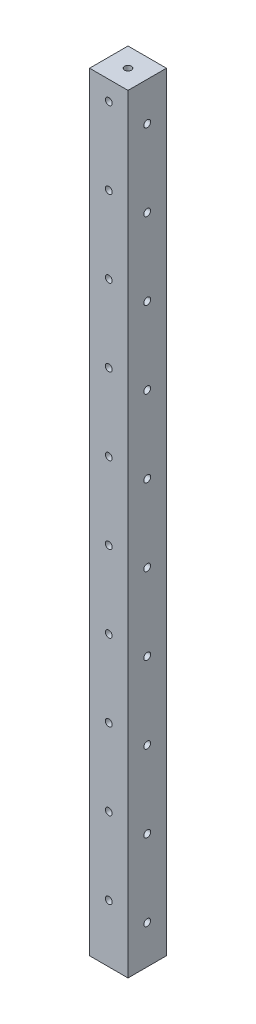
ISO-10303-21;
HEADER;
FILE_DESCRIPTION(('STEP AP214'),'2;1');
FILE_NAME('part.step','',(''),(''),'','','');
FILE_SCHEMA(('AUTOMOTIVE_DESIGN { 1 0 10303 214 1 1 1 1 }'));
ENDSEC;
DATA;
#1=APPLICATION_CONTEXT('core data for automotive mechanical design processes');
#2=APPLICATION_PROTOCOL_DEFINITION('international standard','automotive_design',2000,#1);
#3=PRODUCT_CONTEXT('',#1,'mechanical');
#4=PRODUCT('Part','Part','',(#3));
#5=PRODUCT_RELATED_PRODUCT_CATEGORY('part','',(#4));
#6=PRODUCT_DEFINITION_FORMATION('','',#4);
#7=PRODUCT_DEFINITION_CONTEXT('part definition',#1,'design');
#8=PRODUCT_DEFINITION('design','',#6,#7);
#9=PRODUCT_DEFINITION_SHAPE('','',#8);
#10=(LENGTH_UNIT() NAMED_UNIT(*) SI_UNIT(.MILLI.,.METRE.));
#11=(NAMED_UNIT(*) PLANE_ANGLE_UNIT() SI_UNIT($,.RADIAN.));
#12=(NAMED_UNIT(*) SI_UNIT($,.STERADIAN.) SOLID_ANGLE_UNIT());
#13=UNCERTAINTY_MEASURE_WITH_UNIT(LENGTH_MEASURE(1.E-05),#10,'distance_accuracy_value','');
#14=(GEOMETRIC_REPRESENTATION_CONTEXT(3) GLOBAL_UNCERTAINTY_ASSIGNED_CONTEXT((#13)) GLOBAL_UNIT_ASSIGNED_CONTEXT((#10,
#11,#12)) REPRESENTATION_CONTEXT('',''));
#15=CARTESIAN_POINT('',(0.,0.,0.));
#16=DIRECTION('',(0.,0.,1.));
#17=DIRECTION('',(1.,0.,0.));
#18=AXIS2_PLACEMENT_3D('',#15,#16,#17);
#19=CARTESIAN_POINT('',(0.,254.,0.));
#20=DIRECTION('',(1.,0.,0.));
#21=DIRECTION('',(0.,0.,-1.));
#22=AXIS2_PLACEMENT_3D('',#19,#20,#21);
#23=PLANE('',#22);
#24=CARTESIAN_POINT('',(0.,12.7,6.35));
#25=DIRECTION('',(-1.,0.,0.));
#26=DIRECTION('',(0.,0.,1.));
#27=AXIS2_PLACEMENT_3D('',#24,#25,#26);
#28=CIRCLE('',#27,1.13029999999999);
#29=CARTESIAN_POINT('',(0.,12.7,7.48029999999999));
#30=VERTEX_POINT('',#29);
#31=EDGE_CURVE('E269',#30,#30,#28,.T.);
#32=ORIENTED_EDGE('',*,*,#31,.F.);
#33=EDGE_LOOP('',(#32));
#34=FACE_BOUND('',#33,.T.);
#35=CARTESIAN_POINT('',(0.,38.1,6.35));
#36=DIRECTION('',(-1.,0.,0.));
#37=DIRECTION('',(0.,0.,1.));
#38=AXIS2_PLACEMENT_3D('',#35,#36,#37);
#39=CIRCLE('',#38,1.13029999999999);
#40=CARTESIAN_POINT('',(0.,38.1,7.48029999999999));
#41=VERTEX_POINT('',#40);
#42=EDGE_CURVE('E263',#41,#41,#39,.T.);
#43=ORIENTED_EDGE('',*,*,#42,.F.);
#44=EDGE_LOOP('',(#43));
#45=FACE_BOUND('',#44,.T.);
#46=CARTESIAN_POINT('',(0.,63.5,6.35));
#47=DIRECTION('',(-1.,0.,0.));
#48=DIRECTION('',(0.,0.,1.));
#49=AXIS2_PLACEMENT_3D('',#46,#47,#48);
#50=CIRCLE('',#49,1.13029999999999);
#51=CARTESIAN_POINT('',(0.,63.5,7.48029999999999));
#52=VERTEX_POINT('',#51);
#53=EDGE_CURVE('E257',#52,#52,#50,.T.);
#54=ORIENTED_EDGE('',*,*,#53,.F.);
#55=EDGE_LOOP('',(#54));
#56=FACE_BOUND('',#55,.T.);
#57=CARTESIAN_POINT('',(0.,88.9,6.35));
#58=DIRECTION('',(-1.,0.,0.));
#59=DIRECTION('',(0.,0.,1.));
#60=AXIS2_PLACEMENT_3D('',#57,#58,#59);
#61=CIRCLE('',#60,1.13029999999999);
#62=CARTESIAN_POINT('',(0.,88.9,7.48029999999999));
#63=VERTEX_POINT('',#62);
#64=EDGE_CURVE('E251',#63,#63,#61,.T.);
#65=ORIENTED_EDGE('',*,*,#64,.F.);
#66=EDGE_LOOP('',(#65));
#67=FACE_BOUND('',#66,.T.);
#68=CARTESIAN_POINT('',(0.,114.3,6.35));
#69=DIRECTION('',(-1.,0.,0.));
#70=DIRECTION('',(0.,0.,1.));
#71=AXIS2_PLACEMENT_3D('',#68,#69,#70);
#72=CIRCLE('',#71,1.13029999999999);
#73=CARTESIAN_POINT('',(0.,114.3,7.48029999999999));
#74=VERTEX_POINT('',#73);
#75=EDGE_CURVE('E245',#74,#74,#72,.T.);
#76=ORIENTED_EDGE('',*,*,#75,.F.);
#77=EDGE_LOOP('',(#76));
#78=FACE_BOUND('',#77,.T.);
#79=CARTESIAN_POINT('',(0.,139.7,6.35));
#80=DIRECTION('',(-1.,0.,0.));
#81=DIRECTION('',(0.,0.,1.));
#82=AXIS2_PLACEMENT_3D('',#79,#80,#81);
#83=CIRCLE('',#82,1.1303);
#84=CARTESIAN_POINT('',(0.,139.7,7.4803));
#85=VERTEX_POINT('',#84);
#86=EDGE_CURVE('E239',#85,#85,#83,.T.);
#87=ORIENTED_EDGE('',*,*,#86,.F.);
#88=EDGE_LOOP('',(#87));
#89=FACE_BOUND('',#88,.T.);
#90=CARTESIAN_POINT('',(0.,165.1,6.35));
#91=DIRECTION('',(-1.,0.,0.));
#92=DIRECTION('',(0.,0.,1.));
#93=AXIS2_PLACEMENT_3D('',#90,#91,#92);
#94=CIRCLE('',#93,1.13029999999997);
#95=CARTESIAN_POINT('',(0.,165.1,7.48029999999997));
#96=VERTEX_POINT('',#95);
#97=EDGE_CURVE('E233',#96,#96,#94,.T.);
#98=ORIENTED_EDGE('',*,*,#97,.F.);
#99=EDGE_LOOP('',(#98));
#100=FACE_BOUND('',#99,.T.);
#101=CARTESIAN_POINT('',(0.,190.5,6.35));
#102=DIRECTION('',(-1.,0.,0.));
#103=DIRECTION('',(0.,0.,1.));
#104=AXIS2_PLACEMENT_3D('',#101,#102,#103);
#105=CIRCLE('',#104,1.13029999999997);
#106=CARTESIAN_POINT('',(0.,190.5,7.48029999999997));
#107=VERTEX_POINT('',#106);
#108=EDGE_CURVE('E227',#107,#107,#105,.T.);
#109=ORIENTED_EDGE('',*,*,#108,.F.);
#110=EDGE_LOOP('',(#109));
#111=FACE_BOUND('',#110,.T.);
#112=CARTESIAN_POINT('',(0.,241.3,6.35));
#113=DIRECTION('',(-1.,0.,0.));
#114=DIRECTION('',(0.,0.,1.));
#115=AXIS2_PLACEMENT_3D('',#112,#113,#114);
#116=CIRCLE('',#115,1.13029999999997);
#117=CARTESIAN_POINT('',(0.,241.3,7.48029999999997));
#118=VERTEX_POINT('',#117);
#119=EDGE_CURVE('E215',#118,#118,#116,.T.);
#120=ORIENTED_EDGE('',*,*,#119,.F.);
#121=EDGE_LOOP('',(#120));
#122=FACE_BOUND('',#121,.T.);
#123=DIRECTION('',(0.,0.,1.));
#124=VECTOR('',#123,1.);
#125=CARTESIAN_POINT('',(0.,0.,0.));
#126=LINE('',#125,#124);
#127=CARTESIAN_POINT('',(0.,0.,0.));
#128=VERTEX_POINT('',#127);
#129=CARTESIAN_POINT('',(0.,0.,12.7));
#130=VERTEX_POINT('',#129);
#131=EDGE_CURVE('E132',#128,#130,#126,.T.);
#132=ORIENTED_EDGE('',*,*,#131,.T.);
#133=DIRECTION('',(0.,-1.,0.));
#134=VECTOR('',#133,1.);
#135=CARTESIAN_POINT('',(0.,254.,12.7));
#136=LINE('',#135,#134);
#137=CARTESIAN_POINT('',(0.,254.,12.7));
#138=VERTEX_POINT('',#137);
#139=EDGE_CURVE('E112',#138,#130,#136,.T.);
#140=ORIENTED_EDGE('',*,*,#139,.F.);
#141=DIRECTION('',(0.,0.,1.));
#142=VECTOR('',#141,1.);
#143=CARTESIAN_POINT('',(0.,254.,0.));
#144=LINE('',#143,#142);
#145=CARTESIAN_POINT('',(0.,254.,0.));
#146=VERTEX_POINT('',#145);
#147=EDGE_CURVE('E127',#146,#138,#144,.T.);
#148=ORIENTED_EDGE('',*,*,#147,.F.);
#149=DIRECTION('',(0.,-1.,0.));
#150=VECTOR('',#149,1.);
#151=CARTESIAN_POINT('',(0.,254.,0.));
#152=LINE('',#151,#150);
#153=EDGE_CURVE('E124',#146,#128,#152,.T.);
#154=ORIENTED_EDGE('',*,*,#153,.T.);
#155=EDGE_LOOP('',(#132,#140,#148,#154));
#156=FACE_BOUND('',#155,.T.);
#157=CARTESIAN_POINT('',(0.,215.9,6.35));
#158=DIRECTION('',(-1.,0.,0.));
#159=DIRECTION('',(0.,0.,1.));
#160=AXIS2_PLACEMENT_3D('',#157,#158,#159);
#161=CIRCLE('',#160,1.1303);
#162=CARTESIAN_POINT('',(0.,215.9,7.4803));
#163=VERTEX_POINT('',#162);
#164=EDGE_CURVE('E221',#163,#163,#161,.T.);
#165=ORIENTED_EDGE('',*,*,#164,.F.);
#166=EDGE_LOOP('',(#165));
#167=FACE_BOUND('',#166,.T.);
#168=ADVANCED_FACE('F43',(#34,#45,#56,#67,#78,#89,#100,#111,#122,#156,#167),#23,.F.);
#169=CARTESIAN_POINT('',(6.35,254.,6.35));
#170=DIRECTION('',(0.,1.,0.));
#171=DIRECTION('',(0.,0.,1.));
#172=AXIS2_PLACEMENT_3D('',#169,#170,#171);
#173=CYLINDRICAL_SURFACE('',#172,1.1303);
#174=CARTESIAN_POINT('',(6.35,254.,6.35));
#175=DIRECTION('',(0.,1.,0.));
#176=DIRECTION('',(0.,0.,1.));
#177=AXIS2_PLACEMENT_3D('',#174,#175,#176);
#178=CIRCLE('',#177,1.1303);
#179=CARTESIAN_POINT('',(6.35,254.,7.4803));
#180=VERTEX_POINT('',#179);
#181=EDGE_CURVE('E149',#180,#180,#178,.T.);
#182=ORIENTED_EDGE('',*,*,#181,.T.);
#183=EDGE_LOOP('',(#182));
#184=FACE_BOUND('',#183,.T.);
#185=CARTESIAN_POINT('',(6.35,247.65,6.35));
#186=DIRECTION('',(0.,0.707106781186547,0.707106781186547));
#187=DIRECTION('',(0.,0.707106781186547,-0.707106781186547));
#188=AXIS2_PLACEMENT_3D('',#185,#186,#187);
#189=ELLIPSE('',#188,1.5984855895503,1.13029999999999);
#190=CARTESIAN_POINT('',(5.2197,247.65,6.35));
#191=VERTEX_POINT('',#190);
#192=CARTESIAN_POINT('',(7.48029999999999,247.65,6.35));
#193=VERTEX_POINT('',#192);
#194=EDGE_CURVE('E55',#191,#193,#189,.F.);
#195=ORIENTED_EDGE('',*,*,#194,.T.);
#196=CARTESIAN_POINT('',(6.35,247.65,6.35));
#197=DIRECTION('',(0.,0.707106781186547,-0.707106781186547));
#198=DIRECTION('',(0.,0.707106781186547,0.707106781186547));
#199=AXIS2_PLACEMENT_3D('',#196,#197,#198);
#200=ELLIPSE('',#199,1.5984855895503,1.13029999999999);
#201=EDGE_CURVE('E11',#193,#191,#200,.F.);
#202=ORIENTED_EDGE('',*,*,#201,.T.);
#203=EDGE_LOOP('',(#195,#202));
#204=FACE_BOUND('',#203,.T.);
#205=ADVANCED_FACE('F114',(#184,#204),#173,.F.);
#206=CARTESIAN_POINT('',(0.,254.,12.7));
#207=DIRECTION('',(0.,0.,-1.));
#208=DIRECTION('',(-1.,0.,0.));
#209=AXIS2_PLACEMENT_3D('',#206,#207,#208);
#210=PLANE('',#209);
#211=CARTESIAN_POINT('',(6.35,19.05,12.7));
#212=DIRECTION('',(0.,0.,-1.));
#213=DIRECTION('',(-1.,0.,0.));
#214=AXIS2_PLACEMENT_3D('',#211,#212,#213);
#215=CIRCLE('',#214,1.1303);
#216=CARTESIAN_POINT('',(5.2197,19.05,12.7));
#217=VERTEX_POINT('',#216);
#218=EDGE_CURVE('E206',#217,#217,#215,.T.);
#219=ORIENTED_EDGE('',*,*,#218,.T.);
#220=EDGE_LOOP('',(#219));
#221=FACE_BOUND('',#220,.T.);
#222=CARTESIAN_POINT('',(6.35,44.45,12.7));
#223=DIRECTION('',(0.,0.,-1.));
#224=DIRECTION('',(-1.,0.,0.));
#225=AXIS2_PLACEMENT_3D('',#222,#223,#224);
#226=CIRCLE('',#225,1.1303);
#227=CARTESIAN_POINT('',(5.2197,44.45,12.7));
#228=VERTEX_POINT('',#227);
#229=EDGE_CURVE('E200',#228,#228,#226,.T.);
#230=ORIENTED_EDGE('',*,*,#229,.T.);
#231=EDGE_LOOP('',(#230));
#232=FACE_BOUND('',#231,.T.);
#233=CARTESIAN_POINT('',(6.35,69.85,12.7));
#234=DIRECTION('',(0.,0.,-1.));
#235=DIRECTION('',(-1.,0.,0.));
#236=AXIS2_PLACEMENT_3D('',#233,#234,#235);
#237=CIRCLE('',#236,1.1303);
#238=CARTESIAN_POINT('',(5.2197,69.85,12.7));
#239=VERTEX_POINT('',#238);
#240=EDGE_CURVE('E194',#239,#239,#237,.T.);
#241=ORIENTED_EDGE('',*,*,#240,.T.);
#242=EDGE_LOOP('',(#241));
#243=FACE_BOUND('',#242,.T.);
#244=CARTESIAN_POINT('',(6.35,95.25,12.7));
#245=DIRECTION('',(0.,0.,-1.));
#246=DIRECTION('',(-1.,0.,0.));
#247=AXIS2_PLACEMENT_3D('',#244,#245,#246);
#248=CIRCLE('',#247,1.1303);
#249=CARTESIAN_POINT('',(5.2197,95.25,12.7));
#250=VERTEX_POINT('',#249);
#251=EDGE_CURVE('E188',#250,#250,#248,.T.);
#252=ORIENTED_EDGE('',*,*,#251,.T.);
#253=EDGE_LOOP('',(#252));
#254=FACE_BOUND('',#253,.T.);
#255=CARTESIAN_POINT('',(6.35,120.65,12.7));
#256=DIRECTION('',(0.,0.,-1.));
#257=DIRECTION('',(-1.,0.,0.));
#258=AXIS2_PLACEMENT_3D('',#255,#256,#257);
#259=CIRCLE('',#258,1.1303);
#260=CARTESIAN_POINT('',(5.2197,120.65,12.7));
#261=VERTEX_POINT('',#260);
#262=EDGE_CURVE('E182',#261,#261,#259,.T.);
#263=ORIENTED_EDGE('',*,*,#262,.T.);
#264=EDGE_LOOP('',(#263));
#265=FACE_BOUND('',#264,.T.);
#266=CARTESIAN_POINT('',(6.35,146.05,12.7));
#267=DIRECTION('',(0.,0.,-1.));
#268=DIRECTION('',(-1.,0.,0.));
#269=AXIS2_PLACEMENT_3D('',#266,#267,#268);
#270=CIRCLE('',#269,1.1303);
#271=CARTESIAN_POINT('',(5.2197,146.05,12.7));
#272=VERTEX_POINT('',#271);
#273=EDGE_CURVE('E176',#272,#272,#270,.T.);
#274=ORIENTED_EDGE('',*,*,#273,.T.);
#275=EDGE_LOOP('',(#274));
#276=FACE_BOUND('',#275,.T.);
#277=CARTESIAN_POINT('',(6.35,171.45,12.7));
#278=DIRECTION('',(0.,0.,-1.));
#279=DIRECTION('',(-1.,0.,0.));
#280=AXIS2_PLACEMENT_3D('',#277,#278,#279);
#281=CIRCLE('',#280,1.1303);
#282=CARTESIAN_POINT('',(5.2197,171.45,12.7));
#283=VERTEX_POINT('',#282);
#284=EDGE_CURVE('E170',#283,#283,#281,.T.);
#285=ORIENTED_EDGE('',*,*,#284,.T.);
#286=EDGE_LOOP('',(#285));
#287=FACE_BOUND('',#286,.T.);
#288=CARTESIAN_POINT('',(6.35,196.85,12.7));
#289=DIRECTION('',(0.,0.,-1.));
#290=DIRECTION('',(-1.,0.,0.));
#291=AXIS2_PLACEMENT_3D('',#288,#289,#290);
#292=CIRCLE('',#291,1.1303);
#293=CARTESIAN_POINT('',(5.2197,196.85,12.7));
#294=VERTEX_POINT('',#293);
#295=EDGE_CURVE('E164',#294,#294,#292,.T.);
#296=ORIENTED_EDGE('',*,*,#295,.T.);
#297=EDGE_LOOP('',(#296));
#298=FACE_BOUND('',#297,.T.);
#299=CARTESIAN_POINT('',(6.35,222.25,12.7));
#300=DIRECTION('',(0.,0.,-1.));
#301=DIRECTION('',(-1.,0.,0.));
#302=AXIS2_PLACEMENT_3D('',#299,#300,#301);
#303=CIRCLE('',#302,1.1303);
#304=CARTESIAN_POINT('',(5.2197,222.25,12.7));
#305=VERTEX_POINT('',#304);
#306=EDGE_CURVE('E158',#305,#305,#303,.T.);
#307=ORIENTED_EDGE('',*,*,#306,.T.);
#308=EDGE_LOOP('',(#307));
#309=FACE_BOUND('',#308,.T.);
#310=CARTESIAN_POINT('',(6.35,247.65,12.7));
#311=DIRECTION('',(0.,0.,-1.));
#312=DIRECTION('',(-1.,0.,0.));
#313=AXIS2_PLACEMENT_3D('',#310,#311,#312);
#314=CIRCLE('',#313,1.1303);
#315=CARTESIAN_POINT('',(5.2197,247.65,12.7));
#316=VERTEX_POINT('',#315);
#317=EDGE_CURVE('E152',#316,#316,#314,.T.);
#318=ORIENTED_EDGE('',*,*,#317,.T.);
#319=EDGE_LOOP('',(#318));
#320=FACE_BOUND('',#319,.T.);
#321=DIRECTION('',(1.,0.,0.));
#322=VECTOR('',#321,1.);
#323=CARTESIAN_POINT('',(0.,0.,12.7));
#324=LINE('',#323,#322);
#325=CARTESIAN_POINT('',(12.7,0.,12.7));
#326=VERTEX_POINT('',#325);
#327=EDGE_CURVE('E130',#130,#326,#324,.T.);
#328=ORIENTED_EDGE('',*,*,#327,.T.);
#329=DIRECTION('',(0.,-1.,0.));
#330=VECTOR('',#329,1.);
#331=CARTESIAN_POINT('',(12.7,254.,12.7));
#332=LINE('',#331,#330);
#333=CARTESIAN_POINT('',(12.7,254.,12.7));
#334=VERTEX_POINT('',#333);
#335=EDGE_CURVE('E119',#334,#326,#332,.T.);
#336=ORIENTED_EDGE('',*,*,#335,.F.);
#337=DIRECTION('',(1.,0.,0.));
#338=VECTOR('',#337,1.);
#339=CARTESIAN_POINT('',(0.,254.,12.7));
#340=LINE('',#339,#338);
#341=EDGE_CURVE('E93',#138,#334,#340,.T.);
#342=ORIENTED_EDGE('',*,*,#341,.F.);
#343=ORIENTED_EDGE('',*,*,#139,.T.);
#344=EDGE_LOOP('',(#328,#336,#342,#343));
#345=FACE_BOUND('',#344,.T.);
#346=ADVANCED_FACE('F383',(#221,#232,#243,#254,#265,#276,#287,#298,#309,#320,#345),#210,.F.);
#347=CARTESIAN_POINT('',(12.7,254.,0.));
#348=DIRECTION('',(-1.,0.,0.));
#349=DIRECTION('',(0.,0.,1.));
#350=AXIS2_PLACEMENT_3D('',#347,#348,#349);
#351=PLANE('',#350);
#352=CARTESIAN_POINT('',(12.7,12.7,6.35));
#353=DIRECTION('',(-1.,0.,0.));
#354=DIRECTION('',(0.,0.,1.));
#355=AXIS2_PLACEMENT_3D('',#352,#353,#354);
#356=CIRCLE('',#355,1.1303);
#357=CARTESIAN_POINT('',(12.7,12.7,7.48029999999999));
#358=VERTEX_POINT('',#357);
#359=EDGE_CURVE('E266',#358,#358,#356,.T.);
#360=ORIENTED_EDGE('',*,*,#359,.T.);
#361=EDGE_LOOP('',(#360));
#362=FACE_BOUND('',#361,.T.);
#363=CARTESIAN_POINT('',(12.7,38.1,6.35));
#364=DIRECTION('',(-1.,0.,0.));
#365=DIRECTION('',(0.,0.,1.));
#366=AXIS2_PLACEMENT_3D('',#363,#364,#365);
#367=CIRCLE('',#366,1.13029999999999);
#368=CARTESIAN_POINT('',(12.7,38.1,7.48029999999999));
#369=VERTEX_POINT('',#368);
#370=EDGE_CURVE('E260',#369,#369,#367,.T.);
#371=ORIENTED_EDGE('',*,*,#370,.T.);
#372=EDGE_LOOP('',(#371));
#373=FACE_BOUND('',#372,.T.);
#374=CARTESIAN_POINT('',(12.7,63.5,6.35));
#375=DIRECTION('',(-1.,0.,0.));
#376=DIRECTION('',(0.,0.,1.));
#377=AXIS2_PLACEMENT_3D('',#374,#375,#376);
#378=CIRCLE('',#377,1.1303);
#379=CARTESIAN_POINT('',(12.7,63.5,7.4803));
#380=VERTEX_POINT('',#379);
#381=EDGE_CURVE('E254',#380,#380,#378,.T.);
#382=ORIENTED_EDGE('',*,*,#381,.T.);
#383=EDGE_LOOP('',(#382));
#384=FACE_BOUND('',#383,.T.);
#385=CARTESIAN_POINT('',(12.7,88.9,6.35));
#386=DIRECTION('',(-1.,0.,0.));
#387=DIRECTION('',(0.,0.,1.));
#388=AXIS2_PLACEMENT_3D('',#385,#386,#387);
#389=CIRCLE('',#388,1.1303);
#390=CARTESIAN_POINT('',(12.7,88.9,7.4803));
#391=VERTEX_POINT('',#390);
#392=EDGE_CURVE('E248',#391,#391,#389,.T.);
#393=ORIENTED_EDGE('',*,*,#392,.T.);
#394=EDGE_LOOP('',(#393));
#395=FACE_BOUND('',#394,.T.);
#396=CARTESIAN_POINT('',(12.7,114.3,6.35));
#397=DIRECTION('',(-1.,0.,0.));
#398=DIRECTION('',(0.,0.,1.));
#399=AXIS2_PLACEMENT_3D('',#396,#397,#398);
#400=CIRCLE('',#399,1.1303);
#401=CARTESIAN_POINT('',(12.7,114.3,7.4803));
#402=VERTEX_POINT('',#401);
#403=EDGE_CURVE('E242',#402,#402,#400,.T.);
#404=ORIENTED_EDGE('',*,*,#403,.T.);
#405=EDGE_LOOP('',(#404));
#406=FACE_BOUND('',#405,.T.);
#407=CARTESIAN_POINT('',(12.7,139.7,6.35));
#408=DIRECTION('',(-1.,0.,0.));
#409=DIRECTION('',(0.,0.,1.));
#410=AXIS2_PLACEMENT_3D('',#407,#408,#409);
#411=CIRCLE('',#410,1.1303);
#412=CARTESIAN_POINT('',(12.7,139.7,7.4803));
#413=VERTEX_POINT('',#412);
#414=EDGE_CURVE('E236',#413,#413,#411,.T.);
#415=ORIENTED_EDGE('',*,*,#414,.T.);
#416=EDGE_LOOP('',(#415));
#417=FACE_BOUND('',#416,.T.);
#418=CARTESIAN_POINT('',(12.7,165.1,6.35));
#419=DIRECTION('',(-1.,0.,0.));
#420=DIRECTION('',(0.,0.,1.));
#421=AXIS2_PLACEMENT_3D('',#418,#419,#420);
#422=CIRCLE('',#421,1.1303);
#423=CARTESIAN_POINT('',(12.7,165.1,7.4803));
#424=VERTEX_POINT('',#423);
#425=EDGE_CURVE('E230',#424,#424,#422,.T.);
#426=ORIENTED_EDGE('',*,*,#425,.T.);
#427=EDGE_LOOP('',(#426));
#428=FACE_BOUND('',#427,.T.);
#429=CARTESIAN_POINT('',(12.7,190.5,6.35));
#430=DIRECTION('',(-1.,0.,0.));
#431=DIRECTION('',(0.,0.,1.));
#432=AXIS2_PLACEMENT_3D('',#429,#430,#431);
#433=CIRCLE('',#432,1.1303);
#434=CARTESIAN_POINT('',(12.7,190.5,7.4803));
#435=VERTEX_POINT('',#434);
#436=EDGE_CURVE('E224',#435,#435,#433,.T.);
#437=ORIENTED_EDGE('',*,*,#436,.T.);
#438=EDGE_LOOP('',(#437));
#439=FACE_BOUND('',#438,.T.);
#440=CARTESIAN_POINT('',(12.7,215.9,6.35));
#441=DIRECTION('',(-1.,0.,0.));
#442=DIRECTION('',(0.,0.,1.));
#443=AXIS2_PLACEMENT_3D('',#440,#441,#442);
#444=CIRCLE('',#443,1.1303);
#445=CARTESIAN_POINT('',(12.7,215.9,7.4803));
#446=VERTEX_POINT('',#445);
#447=EDGE_CURVE('E218',#446,#446,#444,.T.);
#448=ORIENTED_EDGE('',*,*,#447,.T.);
#449=EDGE_LOOP('',(#448));
#450=FACE_BOUND('',#449,.T.);
#451=CARTESIAN_POINT('',(12.7,241.3,6.35));
#452=DIRECTION('',(-1.,0.,0.));
#453=DIRECTION('',(0.,0.,1.));
#454=AXIS2_PLACEMENT_3D('',#451,#452,#453);
#455=CIRCLE('',#454,1.1303);
#456=CARTESIAN_POINT('',(12.7,241.3,7.4803));
#457=VERTEX_POINT('',#456);
#458=EDGE_CURVE('E212',#457,#457,#455,.T.);
#459=ORIENTED_EDGE('',*,*,#458,.T.);
#460=EDGE_LOOP('',(#459));
#461=FACE_BOUND('',#460,.T.);
#462=DIRECTION('',(0.,0.,-1.));
#463=VECTOR('',#462,1.);
#464=CARTESIAN_POINT('',(12.7,0.,0.));
#465=LINE('',#464,#463);
#466=CARTESIAN_POINT('',(12.7,0.,0.));
#467=VERTEX_POINT('',#466);
#468=EDGE_CURVE('E128',#326,#467,#465,.T.);
#469=ORIENTED_EDGE('',*,*,#468,.T.);
#470=DIRECTION('',(0.,-1.,0.));
#471=VECTOR('',#470,1.);
#472=CARTESIAN_POINT('',(12.7,254.,0.));
#473=LINE('',#472,#471);
#474=CARTESIAN_POINT('',(12.7,254.,0.));
#475=VERTEX_POINT('',#474);
#476=EDGE_CURVE('E122',#475,#467,#473,.T.);
#477=ORIENTED_EDGE('',*,*,#476,.F.);
#478=DIRECTION('',(0.,0.,-1.));
#479=VECTOR('',#478,1.);
#480=CARTESIAN_POINT('',(12.7,254.,0.));
#481=LINE('',#480,#479);
#482=EDGE_CURVE('E137',#334,#475,#481,.T.);
#483=ORIENTED_EDGE('',*,*,#482,.F.);
#484=ORIENTED_EDGE('',*,*,#335,.T.);
#485=EDGE_LOOP('',(#469,#477,#483,#484));
#486=FACE_BOUND('',#485,.T.);
#487=ADVANCED_FACE('F380',(#362,#373,#384,#395,#406,#417,#428,#439,#450,#461,#486),#351,.F.);
#488=CARTESIAN_POINT('',(0.,254.,0.));
#489=DIRECTION('',(0.,0.,1.));
#490=DIRECTION('',(1.,0.,0.));
#491=AXIS2_PLACEMENT_3D('',#488,#489,#490);
#492=PLANE('',#491);
#493=CARTESIAN_POINT('',(6.35,19.05,0.));
#494=DIRECTION('',(0.,0.,-1.));
#495=DIRECTION('',(-1.,0.,0.));
#496=AXIS2_PLACEMENT_3D('',#493,#494,#495);
#497=CIRCLE('',#496,1.13029999999999);
#498=CARTESIAN_POINT('',(5.21970000000001,19.05,0.));
#499=VERTEX_POINT('',#498);
#500=EDGE_CURVE('E209',#499,#499,#497,.T.);
#501=ORIENTED_EDGE('',*,*,#500,.F.);
#502=EDGE_LOOP('',(#501));
#503=FACE_BOUND('',#502,.T.);
#504=CARTESIAN_POINT('',(6.35,44.45,0.));
#505=DIRECTION('',(0.,0.,-1.));
#506=DIRECTION('',(-1.,0.,0.));
#507=AXIS2_PLACEMENT_3D('',#504,#505,#506);
#508=CIRCLE('',#507,1.13029999999999);
#509=CARTESIAN_POINT('',(5.21970000000001,44.45,0.));
#510=VERTEX_POINT('',#509);
#511=EDGE_CURVE('E203',#510,#510,#508,.T.);
#512=ORIENTED_EDGE('',*,*,#511,.F.);
#513=EDGE_LOOP('',(#512));
#514=FACE_BOUND('',#513,.T.);
#515=CARTESIAN_POINT('',(6.35,69.85,0.));
#516=DIRECTION('',(0.,0.,-1.));
#517=DIRECTION('',(-1.,0.,0.));
#518=AXIS2_PLACEMENT_3D('',#515,#516,#517);
#519=CIRCLE('',#518,1.13029999999999);
#520=CARTESIAN_POINT('',(5.21970000000001,69.85,0.));
#521=VERTEX_POINT('',#520);
#522=EDGE_CURVE('E197',#521,#521,#519,.T.);
#523=ORIENTED_EDGE('',*,*,#522,.F.);
#524=EDGE_LOOP('',(#523));
#525=FACE_BOUND('',#524,.T.);
#526=CARTESIAN_POINT('',(6.35,95.25,0.));
#527=DIRECTION('',(0.,0.,-1.));
#528=DIRECTION('',(-1.,0.,0.));
#529=AXIS2_PLACEMENT_3D('',#526,#527,#528);
#530=CIRCLE('',#529,1.13029999999999);
#531=CARTESIAN_POINT('',(5.21970000000001,95.25,0.));
#532=VERTEX_POINT('',#531);
#533=EDGE_CURVE('E191',#532,#532,#530,.T.);
#534=ORIENTED_EDGE('',*,*,#533,.F.);
#535=EDGE_LOOP('',(#534));
#536=FACE_BOUND('',#535,.T.);
#537=CARTESIAN_POINT('',(6.35,120.65,0.));
#538=DIRECTION('',(0.,0.,-1.));
#539=DIRECTION('',(-1.,0.,0.));
#540=AXIS2_PLACEMENT_3D('',#537,#538,#539);
#541=CIRCLE('',#540,1.13029999999999);
#542=CARTESIAN_POINT('',(5.21970000000001,120.65,0.));
#543=VERTEX_POINT('',#542);
#544=EDGE_CURVE('E185',#543,#543,#541,.T.);
#545=ORIENTED_EDGE('',*,*,#544,.F.);
#546=EDGE_LOOP('',(#545));
#547=FACE_BOUND('',#546,.T.);
#548=CARTESIAN_POINT('',(6.35,146.05,0.));
#549=DIRECTION('',(0.,0.,-1.));
#550=DIRECTION('',(-1.,0.,0.));
#551=AXIS2_PLACEMENT_3D('',#548,#549,#550);
#552=CIRCLE('',#551,1.13029999999999);
#553=CARTESIAN_POINT('',(5.21970000000001,146.05,0.));
#554=VERTEX_POINT('',#553);
#555=EDGE_CURVE('E179',#554,#554,#552,.T.);
#556=ORIENTED_EDGE('',*,*,#555,.F.);
#557=EDGE_LOOP('',(#556));
#558=FACE_BOUND('',#557,.T.);
#559=CARTESIAN_POINT('',(6.35,171.45,0.));
#560=DIRECTION('',(0.,0.,-1.));
#561=DIRECTION('',(-1.,0.,0.));
#562=AXIS2_PLACEMENT_3D('',#559,#560,#561);
#563=CIRCLE('',#562,1.13029999999999);
#564=CARTESIAN_POINT('',(5.21970000000001,171.45,0.));
#565=VERTEX_POINT('',#564);
#566=EDGE_CURVE('E173',#565,#565,#563,.T.);
#567=ORIENTED_EDGE('',*,*,#566,.F.);
#568=EDGE_LOOP('',(#567));
#569=FACE_BOUND('',#568,.T.);
#570=CARTESIAN_POINT('',(6.35,196.85,0.));
#571=DIRECTION('',(0.,0.,-1.));
#572=DIRECTION('',(-1.,0.,0.));
#573=AXIS2_PLACEMENT_3D('',#570,#571,#572);
#574=CIRCLE('',#573,1.13029999999999);
#575=CARTESIAN_POINT('',(5.21970000000001,196.85,0.));
#576=VERTEX_POINT('',#575);
#577=EDGE_CURVE('E167',#576,#576,#574,.T.);
#578=ORIENTED_EDGE('',*,*,#577,.F.);
#579=EDGE_LOOP('',(#578));
#580=FACE_BOUND('',#579,.T.);
#581=CARTESIAN_POINT('',(6.35,222.25,0.));
#582=DIRECTION('',(0.,0.,-1.));
#583=DIRECTION('',(-1.,0.,0.));
#584=AXIS2_PLACEMENT_3D('',#581,#582,#583);
#585=CIRCLE('',#584,1.13029999999999);
#586=CARTESIAN_POINT('',(5.21970000000001,222.25,0.));
#587=VERTEX_POINT('',#586);
#588=EDGE_CURVE('E161',#587,#587,#585,.T.);
#589=ORIENTED_EDGE('',*,*,#588,.F.);
#590=EDGE_LOOP('',(#589));
#591=FACE_BOUND('',#590,.T.);
#592=CARTESIAN_POINT('',(6.35,247.65,0.));
#593=DIRECTION('',(0.,0.,-1.));
#594=DIRECTION('',(-1.,0.,0.));
#595=AXIS2_PLACEMENT_3D('',#592,#593,#594);
#596=CIRCLE('',#595,1.13029999999999);
#597=CARTESIAN_POINT('',(5.21970000000001,247.65,0.));
#598=VERTEX_POINT('',#597);
#599=EDGE_CURVE('E155',#598,#598,#596,.T.);
#600=ORIENTED_EDGE('',*,*,#599,.F.);
#601=EDGE_LOOP('',(#600));
#602=FACE_BOUND('',#601,.T.);
#603=DIRECTION('',(-1.,0.,0.));
#604=VECTOR('',#603,1.);
#605=CARTESIAN_POINT('',(0.,0.,0.));
#606=LINE('',#605,#604);
#607=EDGE_CURVE('E85',#467,#128,#606,.T.);
#608=ORIENTED_EDGE('',*,*,#607,.T.);
#609=ORIENTED_EDGE('',*,*,#153,.F.);
#610=DIRECTION('',(-1.,0.,0.));
#611=VECTOR('',#610,1.);
#612=CARTESIAN_POINT('',(0.,254.,0.));
#613=LINE('',#612,#611);
#614=EDGE_CURVE('E64',#475,#146,#613,.T.);
#615=ORIENTED_EDGE('',*,*,#614,.F.);
#616=ORIENTED_EDGE('',*,*,#476,.T.);
#617=EDGE_LOOP('',(#608,#609,#615,#616));
#618=FACE_BOUND('',#617,.T.);
#619=ADVANCED_FACE('F373',(#503,#514,#525,#536,#547,#558,#569,#580,#591,#602,#618),#492,.F.);
#620=CARTESIAN_POINT('',(0.,254.,0.));
#621=DIRECTION('',(0.,1.,0.));
#622=DIRECTION('',(0.,0.,1.));
#623=AXIS2_PLACEMENT_3D('',#620,#621,#622);
#624=PLANE('',#623);
#625=ORIENTED_EDGE('',*,*,#181,.F.);
#626=EDGE_LOOP('',(#625));
#627=FACE_BOUND('',#626,.T.);
#628=ORIENTED_EDGE('',*,*,#147,.T.);
#629=ORIENTED_EDGE('',*,*,#341,.T.);
#630=ORIENTED_EDGE('',*,*,#482,.T.);
#631=ORIENTED_EDGE('',*,*,#614,.T.);
#632=EDGE_LOOP('',(#628,#629,#630,#631));
#633=FACE_BOUND('',#632,.T.);
#634=ADVANCED_FACE('F370',(#627,#633),#624,.T.);
#635=CARTESIAN_POINT('',(0.,0.,0.));
#636=DIRECTION('',(0.,1.,0.));
#637=DIRECTION('',(0.,0.,1.));
#638=AXIS2_PLACEMENT_3D('',#635,#636,#637);
#639=PLANE('',#638);
#640=CARTESIAN_POINT('',(6.35,0.,6.35));
#641=DIRECTION('',(0.,-1.,0.));
#642=DIRECTION('',(0.,0.,-1.));
#643=AXIS2_PLACEMENT_3D('',#640,#641,#642);
#644=CIRCLE('',#643,1.1303);
#645=CARTESIAN_POINT('',(6.35,0.,5.2197));
#646=VERTEX_POINT('',#645);
#647=EDGE_CURVE('E143',#646,#646,#644,.T.);
#648=ORIENTED_EDGE('',*,*,#647,.F.);
#649=EDGE_LOOP('',(#648));
#650=FACE_BOUND('',#649,.T.);
#651=ORIENTED_EDGE('',*,*,#131,.F.);
#652=ORIENTED_EDGE('',*,*,#607,.F.);
#653=ORIENTED_EDGE('',*,*,#468,.F.);
#654=ORIENTED_EDGE('',*,*,#327,.F.);
#655=EDGE_LOOP('',(#651,#652,#653,#654));
#656=FACE_BOUND('',#655,.T.);
#657=ADVANCED_FACE('F368',(#650,#656),#639,.F.);
#658=CARTESIAN_POINT('',(6.35,7.6,6.35));
#659=DIRECTION('',(0.,-1.,0.));
#660=DIRECTION('',(0.,0.,-1.));
#661=AXIS2_PLACEMENT_3D('',#658,#659,#660);
#662=CONICAL_SURFACE('',#661,1.1303,1.02974425867665);
#663=CARTESIAN_POINT('',(6.35,8.27915275768685,6.35));
#664=VERTEX_POINT('',#663);
#665=VERTEX_LOOP('',#664);
#666=FACE_BOUND('',#665,.T.);
#667=CARTESIAN_POINT('',(6.35,7.6,6.35));
#668=DIRECTION('',(0.,-1.,0.));
#669=DIRECTION('',(0.,0.,-1.));
#670=AXIS2_PLACEMENT_3D('',#667,#668,#669);
#671=CIRCLE('',#670,1.1303);
#672=CARTESIAN_POINT('',(6.35,7.6,5.2197));
#673=VERTEX_POINT('',#672);
#674=EDGE_CURVE('E135',#673,#673,#671,.T.);
#675=ORIENTED_EDGE('',*,*,#674,.T.);
#676=EDGE_LOOP('',(#675));
#677=FACE_BOUND('',#676,.T.);
#678=ADVANCED_FACE('F364',(#666,#677),#662,.F.);
#679=CARTESIAN_POINT('',(6.35,0.,6.35));
#680=DIRECTION('',(0.,-1.,0.));
#681=DIRECTION('',(0.,0.,-1.));
#682=AXIS2_PLACEMENT_3D('',#679,#680,#681);
#683=CYLINDRICAL_SURFACE('',#682,1.1303);
#684=ORIENTED_EDGE('',*,*,#674,.F.);
#685=EDGE_LOOP('',(#684));
#686=FACE_BOUND('',#685,.T.);
#687=ORIENTED_EDGE('',*,*,#647,.T.);
#688=EDGE_LOOP('',(#687));
#689=FACE_BOUND('',#688,.T.);
#690=ADVANCED_FACE('F361',(#686,#689),#683,.F.);
#691=CARTESIAN_POINT('',(6.35,247.65,0.));
#692=DIRECTION('',(0.,0.,-1.));
#693=DIRECTION('',(-1.,0.,0.));
#694=AXIS2_PLACEMENT_3D('',#691,#692,#693);
#695=CYLINDRICAL_SURFACE('',#694,1.13029999999999);
#696=ORIENTED_EDGE('',*,*,#599,.T.);
#697=EDGE_LOOP('',(#696));
#698=FACE_BOUND('',#697,.T.);
#699=ORIENTED_EDGE('',*,*,#194,.F.);
#700=CARTESIAN_POINT('',(6.35,247.65,6.35));
#701=DIRECTION('',(0.,0.707106781186547,-0.707106781186547));
#702=DIRECTION('',(0.,0.707106781186547,0.707106781186547));
#703=AXIS2_PLACEMENT_3D('',#700,#701,#702);
#704=ELLIPSE('',#703,1.5984855895503,1.13029999999999);
#705=EDGE_CURVE('E50',#193,#191,#704,.T.);
#706=ORIENTED_EDGE('',*,*,#705,.F.);
#707=EDGE_LOOP('',(#699,#706));
#708=FACE_BOUND('',#707,.T.);
#709=ADVANCED_FACE('F111',(#698,#708),#695,.F.);
#710=CARTESIAN_POINT('',(6.35,246.4,6.35));
#711=DIRECTION('',(0.,1.,0.));
#712=DIRECTION('',(0.,0.,1.));
#713=AXIS2_PLACEMENT_3D('',#710,#711,#712);
#714=CONICAL_SURFACE('',#713,1.1303,1.02974425867666);
#715=CARTESIAN_POINT('',(6.35,245.720847242313,6.35));
#716=VERTEX_POINT('',#715);
#717=VERTEX_LOOP('',#716);
#718=FACE_BOUND('',#717,.T.);
#719=CARTESIAN_POINT('',(6.35,246.4,6.35));
#720=DIRECTION('',(0.,1.,0.));
#721=DIRECTION('',(0.,0.,1.));
#722=AXIS2_PLACEMENT_3D('',#719,#720,#721);
#723=CIRCLE('',#722,1.1303);
#724=CARTESIAN_POINT('',(6.35,246.4,7.4803));
#725=VERTEX_POINT('',#724);
#726=EDGE_CURVE('E146',#725,#725,#723,.T.);
#727=ORIENTED_EDGE('',*,*,#726,.T.);
#728=EDGE_LOOP('',(#727));
#729=FACE_BOUND('',#728,.T.);
#730=ADVANCED_FACE('F357',(#718,#729),#714,.F.);
#731=CARTESIAN_POINT('',(6.35,247.65,6.35));
#732=DIRECTION('',(0.,0.707106781186547,0.707106781186547));
#733=DIRECTION('',(0.,0.707106781186547,-0.707106781186547));
#734=AXIS2_PLACEMENT_3D('',#731,#732,#733);
#735=ELLIPSE('',#734,1.5984855895503,1.13029999999999);
#736=EDGE_CURVE('E105',#191,#193,#735,.T.);
#737=ORIENTED_EDGE('',*,*,#736,.T.);
#738=ORIENTED_EDGE('',*,*,#705,.T.);
#739=EDGE_LOOP('',(#737,#738));
#740=FACE_BOUND('',#739,.T.);
#741=ORIENTED_EDGE('',*,*,#726,.F.);
#742=EDGE_LOOP('',(#741));
#743=FACE_BOUND('',#742,.T.);
#744=ADVANCED_FACE('F115',(#740,#743),#173,.F.);
#745=ORIENTED_EDGE('',*,*,#317,.F.);
#746=EDGE_LOOP('',(#745));
#747=FACE_BOUND('',#746,.T.);
#748=ORIENTED_EDGE('',*,*,#736,.F.);
#749=ORIENTED_EDGE('',*,*,#201,.F.);
#750=EDGE_LOOP('',(#748,#749));
#751=FACE_BOUND('',#750,.T.);
#752=ADVANCED_FACE('F106',(#747,#751),#695,.F.);
#753=CARTESIAN_POINT('',(6.35,222.25,0.));
#754=DIRECTION('',(0.,0.,-1.));
#755=DIRECTION('',(-1.,0.,0.));
#756=AXIS2_PLACEMENT_3D('',#753,#754,#755);
#757=CYLINDRICAL_SURFACE('',#756,1.13029999999999);
#758=ORIENTED_EDGE('',*,*,#306,.F.);
#759=EDGE_LOOP('',(#758));
#760=FACE_BOUND('',#759,.T.);
#761=ORIENTED_EDGE('',*,*,#588,.T.);
#762=EDGE_LOOP('',(#761));
#763=FACE_BOUND('',#762,.T.);
#764=ADVANCED_FACE('F347',(#760,#763),#757,.F.);
#765=CARTESIAN_POINT('',(6.35,196.85,0.));
#766=DIRECTION('',(0.,0.,-1.));
#767=DIRECTION('',(-1.,0.,0.));
#768=AXIS2_PLACEMENT_3D('',#765,#766,#767);
#769=CYLINDRICAL_SURFACE('',#768,1.13029999999999);
#770=ORIENTED_EDGE('',*,*,#295,.F.);
#771=EDGE_LOOP('',(#770));
#772=FACE_BOUND('',#771,.T.);
#773=ORIENTED_EDGE('',*,*,#577,.T.);
#774=EDGE_LOOP('',(#773));
#775=FACE_BOUND('',#774,.T.);
#776=ADVANCED_FACE('F343',(#772,#775),#769,.F.);
#777=CARTESIAN_POINT('',(6.35,171.45,0.));
#778=DIRECTION('',(0.,0.,-1.));
#779=DIRECTION('',(-1.,0.,0.));
#780=AXIS2_PLACEMENT_3D('',#777,#778,#779);
#781=CYLINDRICAL_SURFACE('',#780,1.13029999999999);
#782=ORIENTED_EDGE('',*,*,#284,.F.);
#783=EDGE_LOOP('',(#782));
#784=FACE_BOUND('',#783,.T.);
#785=ORIENTED_EDGE('',*,*,#566,.T.);
#786=EDGE_LOOP('',(#785));
#787=FACE_BOUND('',#786,.T.);
#788=ADVANCED_FACE('F339',(#784,#787),#781,.F.);
#789=CARTESIAN_POINT('',(6.35,146.05,0.));
#790=DIRECTION('',(0.,0.,-1.));
#791=DIRECTION('',(-1.,0.,0.));
#792=AXIS2_PLACEMENT_3D('',#789,#790,#791);
#793=CYLINDRICAL_SURFACE('',#792,1.13029999999999);
#794=ORIENTED_EDGE('',*,*,#273,.F.);
#795=EDGE_LOOP('',(#794));
#796=FACE_BOUND('',#795,.T.);
#797=ORIENTED_EDGE('',*,*,#555,.T.);
#798=EDGE_LOOP('',(#797));
#799=FACE_BOUND('',#798,.T.);
#800=ADVANCED_FACE('F335',(#796,#799),#793,.F.);
#801=CARTESIAN_POINT('',(6.35,120.65,0.));
#802=DIRECTION('',(0.,0.,-1.));
#803=DIRECTION('',(-1.,0.,0.));
#804=AXIS2_PLACEMENT_3D('',#801,#802,#803);
#805=CYLINDRICAL_SURFACE('',#804,1.13029999999999);
#806=ORIENTED_EDGE('',*,*,#262,.F.);
#807=EDGE_LOOP('',(#806));
#808=FACE_BOUND('',#807,.T.);
#809=ORIENTED_EDGE('',*,*,#544,.T.);
#810=EDGE_LOOP('',(#809));
#811=FACE_BOUND('',#810,.T.);
#812=ADVANCED_FACE('F331',(#808,#811),#805,.F.);
#813=CARTESIAN_POINT('',(6.35,95.25,0.));
#814=DIRECTION('',(0.,0.,-1.));
#815=DIRECTION('',(-1.,0.,0.));
#816=AXIS2_PLACEMENT_3D('',#813,#814,#815);
#817=CYLINDRICAL_SURFACE('',#816,1.13029999999999);
#818=ORIENTED_EDGE('',*,*,#251,.F.);
#819=EDGE_LOOP('',(#818));
#820=FACE_BOUND('',#819,.T.);
#821=ORIENTED_EDGE('',*,*,#533,.T.);
#822=EDGE_LOOP('',(#821));
#823=FACE_BOUND('',#822,.T.);
#824=ADVANCED_FACE('F327',(#820,#823),#817,.F.);
#825=CARTESIAN_POINT('',(6.35,69.85,0.));
#826=DIRECTION('',(0.,0.,-1.));
#827=DIRECTION('',(-1.,0.,0.));
#828=AXIS2_PLACEMENT_3D('',#825,#826,#827);
#829=CYLINDRICAL_SURFACE('',#828,1.13029999999999);
#830=ORIENTED_EDGE('',*,*,#240,.F.);
#831=EDGE_LOOP('',(#830));
#832=FACE_BOUND('',#831,.T.);
#833=ORIENTED_EDGE('',*,*,#522,.T.);
#834=EDGE_LOOP('',(#833));
#835=FACE_BOUND('',#834,.T.);
#836=ADVANCED_FACE('F323',(#832,#835),#829,.F.);
#837=CARTESIAN_POINT('',(6.35,44.45,0.));
#838=DIRECTION('',(0.,0.,-1.));
#839=DIRECTION('',(-1.,0.,0.));
#840=AXIS2_PLACEMENT_3D('',#837,#838,#839);
#841=CYLINDRICAL_SURFACE('',#840,1.13029999999999);
#842=ORIENTED_EDGE('',*,*,#229,.F.);
#843=EDGE_LOOP('',(#842));
#844=FACE_BOUND('',#843,.T.);
#845=ORIENTED_EDGE('',*,*,#511,.T.);
#846=EDGE_LOOP('',(#845));
#847=FACE_BOUND('',#846,.T.);
#848=ADVANCED_FACE('F319',(#844,#847),#841,.F.);
#849=CARTESIAN_POINT('',(6.35,19.05,0.));
#850=DIRECTION('',(0.,0.,-1.));
#851=DIRECTION('',(-1.,0.,0.));
#852=AXIS2_PLACEMENT_3D('',#849,#850,#851);
#853=CYLINDRICAL_SURFACE('',#852,1.13029999999999);
#854=ORIENTED_EDGE('',*,*,#218,.F.);
#855=EDGE_LOOP('',(#854));
#856=FACE_BOUND('',#855,.T.);
#857=ORIENTED_EDGE('',*,*,#500,.T.);
#858=EDGE_LOOP('',(#857));
#859=FACE_BOUND('',#858,.T.);
#860=ADVANCED_FACE('F311',(#856,#859),#853,.F.);
#861=CARTESIAN_POINT('',(0.,241.3,6.35));
#862=DIRECTION('',(-1.,0.,0.));
#863=DIRECTION('',(0.,0.,1.));
#864=AXIS2_PLACEMENT_3D('',#861,#862,#863);
#865=CYLINDRICAL_SURFACE('',#864,1.13029999999999);
#866=ORIENTED_EDGE('',*,*,#458,.F.);
#867=EDGE_LOOP('',(#866));
#868=FACE_BOUND('',#867,.T.);
#869=ORIENTED_EDGE('',*,*,#119,.T.);
#870=EDGE_LOOP('',(#869));
#871=FACE_BOUND('',#870,.T.);
#872=ADVANCED_FACE('F301',(#868,#871),#865,.F.);
#873=CARTESIAN_POINT('',(0.,215.9,6.35));
#874=DIRECTION('',(-1.,0.,0.));
#875=DIRECTION('',(0.,0.,1.));
#876=AXIS2_PLACEMENT_3D('',#873,#874,#875);
#877=CYLINDRICAL_SURFACE('',#876,1.1303);
#878=ORIENTED_EDGE('',*,*,#447,.F.);
#879=EDGE_LOOP('',(#878));
#880=FACE_BOUND('',#879,.T.);
#881=ORIENTED_EDGE('',*,*,#164,.T.);
#882=EDGE_LOOP('',(#881));
#883=FACE_BOUND('',#882,.T.);
#884=ADVANCED_FACE('F298',(#880,#883),#877,.F.);
#885=CARTESIAN_POINT('',(0.,190.5,6.35));
#886=DIRECTION('',(-1.,0.,0.));
#887=DIRECTION('',(0.,0.,1.));
#888=AXIS2_PLACEMENT_3D('',#885,#886,#887);
#889=CYLINDRICAL_SURFACE('',#888,1.13029999999999);
#890=ORIENTED_EDGE('',*,*,#436,.F.);
#891=EDGE_LOOP('',(#890));
#892=FACE_BOUND('',#891,.T.);
#893=ORIENTED_EDGE('',*,*,#108,.T.);
#894=EDGE_LOOP('',(#893));
#895=FACE_BOUND('',#894,.T.);
#896=ADVANCED_FACE('F300',(#892,#895),#889,.F.);
#897=CARTESIAN_POINT('',(0.,165.1,6.35));
#898=DIRECTION('',(-1.,0.,0.));
#899=DIRECTION('',(0.,0.,1.));
#900=AXIS2_PLACEMENT_3D('',#897,#898,#899);
#901=CYLINDRICAL_SURFACE('',#900,1.13029999999999);
#902=ORIENTED_EDGE('',*,*,#425,.F.);
#903=EDGE_LOOP('',(#902));
#904=FACE_BOUND('',#903,.T.);
#905=ORIENTED_EDGE('',*,*,#97,.T.);
#906=EDGE_LOOP('',(#905));
#907=FACE_BOUND('',#906,.T.);
#908=ADVANCED_FACE('F308',(#904,#907),#901,.F.);
#909=CARTESIAN_POINT('',(0.,139.7,6.35));
#910=DIRECTION('',(-1.,0.,0.));
#911=DIRECTION('',(0.,0.,1.));
#912=AXIS2_PLACEMENT_3D('',#909,#910,#911);
#913=CYLINDRICAL_SURFACE('',#912,1.1303);
#914=ORIENTED_EDGE('',*,*,#414,.F.);
#915=EDGE_LOOP('',(#914));
#916=FACE_BOUND('',#915,.T.);
#917=ORIENTED_EDGE('',*,*,#86,.T.);
#918=EDGE_LOOP('',(#917));
#919=FACE_BOUND('',#918,.T.);
#920=ADVANCED_FACE('F536',(#916,#919),#913,.F.);
#921=CARTESIAN_POINT('',(0.,114.3,6.35));
#922=DIRECTION('',(-1.,0.,0.));
#923=DIRECTION('',(0.,0.,1.));
#924=AXIS2_PLACEMENT_3D('',#921,#922,#923);
#925=CYLINDRICAL_SURFACE('',#924,1.13029999999999);
#926=ORIENTED_EDGE('',*,*,#403,.F.);
#927=EDGE_LOOP('',(#926));
#928=FACE_BOUND('',#927,.T.);
#929=ORIENTED_EDGE('',*,*,#75,.T.);
#930=EDGE_LOOP('',(#929));
#931=FACE_BOUND('',#930,.T.);
#932=ADVANCED_FACE('F541',(#928,#931),#925,.F.);
#933=CARTESIAN_POINT('',(0.,88.9,6.35));
#934=DIRECTION('',(-1.,0.,0.));
#935=DIRECTION('',(0.,0.,1.));
#936=AXIS2_PLACEMENT_3D('',#933,#934,#935);
#937=CYLINDRICAL_SURFACE('',#936,1.13029999999999);
#938=ORIENTED_EDGE('',*,*,#392,.F.);
#939=EDGE_LOOP('',(#938));
#940=FACE_BOUND('',#939,.T.);
#941=ORIENTED_EDGE('',*,*,#64,.T.);
#942=EDGE_LOOP('',(#941));
#943=FACE_BOUND('',#942,.T.);
#944=ADVANCED_FACE('F525',(#940,#943),#937,.F.);
#945=CARTESIAN_POINT('',(0.,63.5,6.35));
#946=DIRECTION('',(-1.,0.,0.));
#947=DIRECTION('',(0.,0.,1.));
#948=AXIS2_PLACEMENT_3D('',#945,#946,#947);
#949=CYLINDRICAL_SURFACE('',#948,1.13029999999999);
#950=ORIENTED_EDGE('',*,*,#381,.F.);
#951=EDGE_LOOP('',(#950));
#952=FACE_BOUND('',#951,.T.);
#953=ORIENTED_EDGE('',*,*,#53,.T.);
#954=EDGE_LOOP('',(#953));
#955=FACE_BOUND('',#954,.T.);
#956=ADVANCED_FACE('F518',(#952,#955),#949,.F.);
#957=CARTESIAN_POINT('',(0.,38.1,6.35));
#958=DIRECTION('',(-1.,0.,0.));
#959=DIRECTION('',(0.,0.,1.));
#960=AXIS2_PLACEMENT_3D('',#957,#958,#959);
#961=CYLINDRICAL_SURFACE('',#960,1.13029999999999);
#962=ORIENTED_EDGE('',*,*,#370,.F.);
#963=EDGE_LOOP('',(#962));
#964=FACE_BOUND('',#963,.T.);
#965=ORIENTED_EDGE('',*,*,#42,.T.);
#966=EDGE_LOOP('',(#965));
#967=FACE_BOUND('',#966,.T.);
#968=ADVANCED_FACE('F524',(#964,#967),#961,.F.);
#969=CARTESIAN_POINT('',(0.,12.7,6.35));
#970=DIRECTION('',(-1.,0.,0.));
#971=DIRECTION('',(0.,0.,1.));
#972=AXIS2_PLACEMENT_3D('',#969,#970,#971);
#973=CYLINDRICAL_SURFACE('',#972,1.13029999999999);
#974=ORIENTED_EDGE('',*,*,#359,.F.);
#975=EDGE_LOOP('',(#974));
#976=FACE_BOUND('',#975,.T.);
#977=ORIENTED_EDGE('',*,*,#31,.T.);
#978=EDGE_LOOP('',(#977));
#979=FACE_BOUND('',#978,.T.);
#980=ADVANCED_FACE('F273',(#976,#979),#973,.F.);
#981=CLOSED_SHELL('',(#168,#205,#346,#487,#619,#634,#657,#678,#690,#709,#730,#744,#752,#764,
#776,#788,#800,#812,#824,#836,#848,#860,#872,#884,#896,#908,#920,#932,#944,#956,#968,#980));
#982=MANIFOLD_SOLID_BREP('B2',#981);
#983=ADVANCED_BREP_SHAPE_REPRESENTATION('',(#18,#982),#14);
#984=SHAPE_DEFINITION_REPRESENTATION(#9,#983);
ENDSEC;
END-ISO-10303-21;
